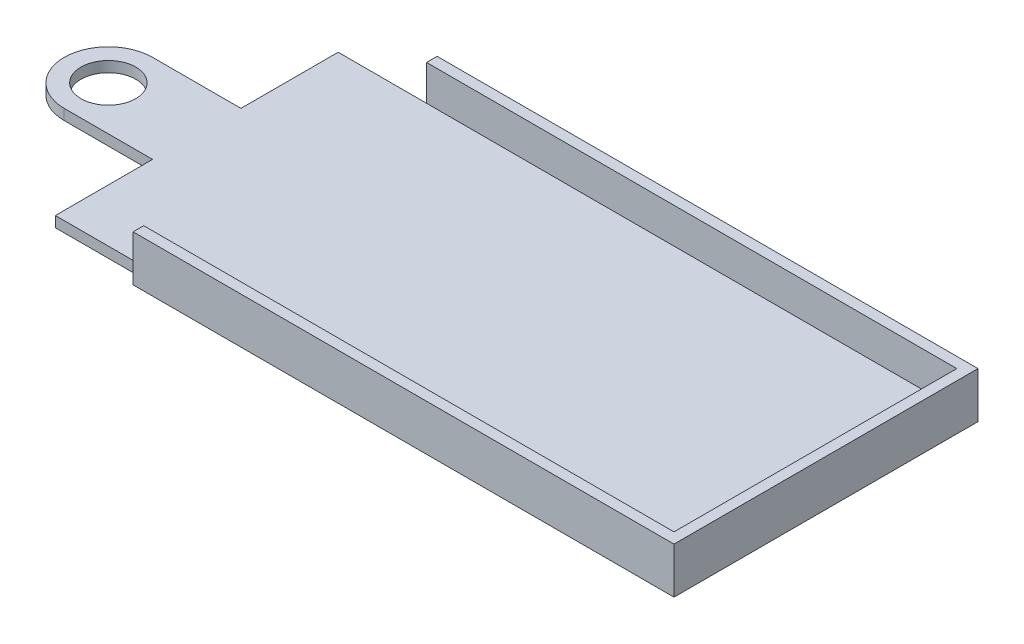
ISO-10303-21;
HEADER;
FILE_DESCRIPTION(('STEP AP214'),'2;1');
FILE_NAME('part.step','',(''),(''),'','','');
FILE_SCHEMA(('AUTOMOTIVE_DESIGN { 1 0 10303 214 1 1 1 1 }'));
ENDSEC;
DATA;
#1=APPLICATION_CONTEXT('core data for automotive mechanical design processes');
#2=APPLICATION_PROTOCOL_DEFINITION('international standard','automotive_design',2000,#1);
#3=PRODUCT_CONTEXT('',#1,'mechanical');
#4=PRODUCT('Part','Part','',(#3));
#5=PRODUCT_RELATED_PRODUCT_CATEGORY('part','',(#4));
#6=PRODUCT_DEFINITION_FORMATION('','',#4);
#7=PRODUCT_DEFINITION_CONTEXT('part definition',#1,'design');
#8=PRODUCT_DEFINITION('design','',#6,#7);
#9=PRODUCT_DEFINITION_SHAPE('','',#8);
#10=(LENGTH_UNIT() NAMED_UNIT(*) SI_UNIT(.MILLI.,.METRE.));
#11=(NAMED_UNIT(*) PLANE_ANGLE_UNIT() SI_UNIT($,.RADIAN.));
#12=(NAMED_UNIT(*) SI_UNIT($,.STERADIAN.) SOLID_ANGLE_UNIT());
#13=UNCERTAINTY_MEASURE_WITH_UNIT(LENGTH_MEASURE(1.E-05),#10,'distance_accuracy_value','');
#14=(GEOMETRIC_REPRESENTATION_CONTEXT(3) GLOBAL_UNCERTAINTY_ASSIGNED_CONTEXT((#13)) GLOBAL_UNIT_ASSIGNED_CONTEXT((#10,
#11,#12)) REPRESENTATION_CONTEXT('',''));
#15=CARTESIAN_POINT('',(0.,0.,0.));
#16=DIRECTION('',(0.,0.,1.));
#17=DIRECTION('',(1.,0.,0.));
#18=AXIS2_PLACEMENT_3D('',#15,#16,#17);
#19=CARTESIAN_POINT('',(-40.,34.7261092284804,-16.));
#20=DIRECTION('',(-1.,0.,0.));
#21=DIRECTION('',(0.,0.,1.));
#22=AXIS2_PLACEMENT_3D('',#19,#20,#21);
#23=PLANE('',#22);
#24=DIRECTION('',(0.,0.,-1.));
#25=VECTOR('',#24,1.);
#26=CARTESIAN_POINT('',(-40.,1.2,-16.));
#27=LINE('',#26,#25);
#28=CARTESIAN_POINT('',(-40.,1.2,16.));
#29=VERTEX_POINT('',#28);
#30=CARTESIAN_POINT('',(-40.,1.2,5.));
#31=VERTEX_POINT('',#30);
#32=EDGE_CURVE('E188',#29,#31,#27,.T.);
#33=ORIENTED_EDGE('',*,*,#32,.T.);
#34=DIRECTION('',(0.,-1.,0.));
#35=VECTOR('',#34,1.);
#36=CARTESIAN_POINT('',(-40.,19.2277563773199,5.));
#37=LINE('',#36,#35);
#38=CARTESIAN_POINT('',(-40.,0.,5.));
#39=VERTEX_POINT('',#38);
#40=EDGE_CURVE('E165',#31,#39,#37,.T.);
#41=ORIENTED_EDGE('',*,*,#40,.T.);
#42=DIRECTION('',(0.,0.,-1.));
#43=VECTOR('',#42,1.);
#44=CARTESIAN_POINT('',(-40.,0.,-16.));
#45=LINE('',#44,#43);
#46=CARTESIAN_POINT('',(-40.,0.,16.));
#47=VERTEX_POINT('',#46);
#48=EDGE_CURVE('E171',#47,#39,#45,.T.);
#49=ORIENTED_EDGE('',*,*,#48,.F.);
#50=DIRECTION('',(0.,-1.,0.));
#51=VECTOR('',#50,1.);
#52=CARTESIAN_POINT('',(-40.,34.7261092284804,16.));
#53=LINE('',#52,#51);
#54=EDGE_CURVE('E184',#29,#47,#53,.T.);
#55=ORIENTED_EDGE('',*,*,#54,.F.);
#56=EDGE_LOOP('',(#33,#41,#49,#55));
#57=FACE_BOUND('',#56,.T.);
#58=ADVANCED_FACE('F35',(#57),#23,.T.);
#59=CARTESIAN_POINT('',(-30.,1.2,16.));
#60=DIRECTION('',(1.,0.,0.));
#61=DIRECTION('',(0.,0.,-1.));
#62=AXIS2_PLACEMENT_3D('',#59,#60,#61);
#63=PLANE('',#62);
#64=DIRECTION('',(0.,-1.,0.));
#65=VECTOR('',#64,1.);
#66=CARTESIAN_POINT('',(-30.,34.7261092284804,-16.));
#67=LINE('',#66,#65);
#68=CARTESIAN_POINT('',(-30.,1.2,-16.));
#69=VERTEX_POINT('',#68);
#70=CARTESIAN_POINT('',(-30.,0.,-16.));
#71=VERTEX_POINT('',#70);
#72=EDGE_CURVE('E187',#69,#71,#67,.T.);
#73=ORIENTED_EDGE('',*,*,#72,.F.);
#74=DIRECTION('',(0.,-1.,0.));
#75=VECTOR('',#74,1.);
#76=CARTESIAN_POINT('',(-30.,79.4054128967276,-16.));
#77=LINE('',#76,#75);
#78=CARTESIAN_POINT('',(-30.,5.2,-16.));
#79=VERTEX_POINT('',#78);
#80=EDGE_CURVE('E231',#79,#69,#77,.T.);
#81=ORIENTED_EDGE('',*,*,#80,.F.);
#82=DIRECTION('',(0.,0.,-1.));
#83=VECTOR('',#82,1.);
#84=CARTESIAN_POINT('',(-30.,5.2,-16.));
#85=LINE('',#84,#83);
#86=CARTESIAN_POINT('',(-30.,5.2,-17.2));
#87=VERTEX_POINT('',#86);
#88=EDGE_CURVE('E228',#79,#87,#85,.T.);
#89=ORIENTED_EDGE('',*,*,#88,.T.);
#90=DIRECTION('',(0.,-1.,0.));
#91=VECTOR('',#90,1.);
#92=CARTESIAN_POINT('',(-30.,79.4054128967276,-17.2));
#93=LINE('',#92,#91);
#94=CARTESIAN_POINT('',(-30.,0.,-17.2));
#95=VERTEX_POINT('',#94);
#96=EDGE_CURVE('E227',#87,#95,#93,.T.);
#97=ORIENTED_EDGE('',*,*,#96,.T.);
#98=DIRECTION('',(0.,0.,1.));
#99=VECTOR('',#98,1.);
#100=CARTESIAN_POINT('',(-30.,0.,16.));
#101=LINE('',#100,#99);
#102=EDGE_CURVE('E257',#95,#71,#101,.T.);
#103=ORIENTED_EDGE('',*,*,#102,.T.);
#104=EDGE_LOOP('',(#73,#81,#89,#97,#103));
#105=FACE_BOUND('',#104,.T.);
#106=ADVANCED_FACE('F322',(#105),#63,.F.);
#107=DIRECTION('',(0.,-1.,0.));
#108=VECTOR('',#107,1.);
#109=CARTESIAN_POINT('',(-30.,79.4054128967276,16.));
#110=LINE('',#109,#108);
#111=CARTESIAN_POINT('',(-30.,5.2,16.));
#112=VERTEX_POINT('',#111);
#113=CARTESIAN_POINT('',(-30.,1.2,16.));
#114=VERTEX_POINT('',#113);
#115=EDGE_CURVE('E214',#112,#114,#110,.T.);
#116=ORIENTED_EDGE('',*,*,#115,.T.);
#117=DIRECTION('',(0.,-1.,0.));
#118=VECTOR('',#117,1.);
#119=CARTESIAN_POINT('',(-30.,34.7261092284804,16.));
#120=LINE('',#119,#118);
#121=CARTESIAN_POINT('',(-30.,0.,16.));
#122=VERTEX_POINT('',#121);
#123=EDGE_CURVE('E193',#114,#122,#120,.T.);
#124=ORIENTED_EDGE('',*,*,#123,.T.);
#125=CARTESIAN_POINT('',(-30.,0.,17.2));
#126=VERTEX_POINT('',#125);
#127=EDGE_CURVE('E253',#122,#126,#101,.T.);
#128=ORIENTED_EDGE('',*,*,#127,.T.);
#129=DIRECTION('',(0.,-1.,0.));
#130=VECTOR('',#129,1.);
#131=CARTESIAN_POINT('',(-30.,79.4054128967276,17.2));
#132=LINE('',#131,#130);
#133=CARTESIAN_POINT('',(-30.,5.2,17.2));
#134=VERTEX_POINT('',#133);
#135=EDGE_CURVE('E215',#134,#126,#132,.T.);
#136=ORIENTED_EDGE('',*,*,#135,.F.);
#137=DIRECTION('',(0.,0.,-1.));
#138=VECTOR('',#137,1.);
#139=CARTESIAN_POINT('',(-30.,5.2,16.));
#140=LINE('',#139,#138);
#141=EDGE_CURVE('E211',#134,#112,#140,.T.);
#142=ORIENTED_EDGE('',*,*,#141,.T.);
#143=EDGE_LOOP('',(#116,#124,#128,#136,#142));
#144=FACE_BOUND('',#143,.T.);
#145=ADVANCED_FACE('F303',(#144),#63,.F.);
#146=CARTESIAN_POINT('',(0.,1.2,0.));
#147=DIRECTION('',(0.,1.,0.));
#148=DIRECTION('',(0.,0.,1.));
#149=AXIS2_PLACEMENT_3D('',#146,#147,#148);
#150=PLANE('',#149);
#151=CARTESIAN_POINT('',(-50.,1.2,0.));
#152=DIRECTION('',(0.,1.,0.));
#153=DIRECTION('',(0.,0.,1.));
#154=AXIS2_PLACEMENT_3D('',#151,#152,#153);
#155=CIRCLE('',#154,3.1);
#156=CARTESIAN_POINT('',(-50.,1.2,3.1));
#157=VERTEX_POINT('',#156);
#158=EDGE_CURVE('E287',#157,#157,#155,.F.);
#159=ORIENTED_EDGE('',*,*,#158,.T.);
#160=EDGE_LOOP('',(#159));
#161=FACE_BOUND('',#160,.T.);
#162=CARTESIAN_POINT('',(-50.,1.2,0.));
#163=DIRECTION('',(0.,1.,0.));
#164=DIRECTION('',(0.,0.,1.));
#165=AXIS2_PLACEMENT_3D('',#162,#163,#164);
#166=CIRCLE('',#165,5.);
#167=CARTESIAN_POINT('',(-50.,1.2,-5.));
#168=VERTEX_POINT('',#167);
#169=CARTESIAN_POINT('',(-55.,1.2,0.));
#170=VERTEX_POINT('',#169);
#171=EDGE_CURVE('E51',#168,#170,#166,.T.);
#172=ORIENTED_EDGE('',*,*,#171,.T.);
#173=CARTESIAN_POINT('',(-50.,1.2,0.));
#174=DIRECTION('',(0.,1.,0.));
#175=DIRECTION('',(0.,0.,1.));
#176=AXIS2_PLACEMENT_3D('',#173,#174,#175);
#177=CIRCLE('',#176,5.);
#178=CARTESIAN_POINT('',(-50.,1.2,5.));
#179=VERTEX_POINT('',#178);
#180=EDGE_CURVE('E44',#170,#179,#177,.T.);
#181=ORIENTED_EDGE('',*,*,#180,.T.);
#182=DIRECTION('',(-1.,0.,0.));
#183=VECTOR('',#182,1.);
#184=CARTESIAN_POINT('',(-40.,1.2,5.));
#185=LINE('',#184,#183);
#186=EDGE_CURVE('E156',#31,#179,#185,.T.);
#187=ORIENTED_EDGE('',*,*,#186,.F.);
#188=ORIENTED_EDGE('',*,*,#32,.F.);
#189=DIRECTION('',(-1.,0.,0.));
#190=VECTOR('',#189,1.);
#191=CARTESIAN_POINT('',(-30.,1.2,16.));
#192=LINE('',#191,#190);
#193=EDGE_CURVE('E181',#114,#29,#192,.T.);
#194=ORIENTED_EDGE('',*,*,#193,.F.);
#195=DIRECTION('',(1.,0.,0.));
#196=VECTOR('',#195,1.);
#197=CARTESIAN_POINT('',(30.,1.2,16.));
#198=LINE('',#197,#196);
#199=CARTESIAN_POINT('',(30.,1.2,16.));
#200=VERTEX_POINT('',#199);
#201=EDGE_CURVE('E254',#114,#200,#198,.T.);
#202=ORIENTED_EDGE('',*,*,#201,.T.);
#203=DIRECTION('',(0.,0.,-1.));
#204=VECTOR('',#203,1.);
#205=CARTESIAN_POINT('',(30.,1.2,16.));
#206=LINE('',#205,#204);
#207=CARTESIAN_POINT('',(30.,1.2,-16.));
#208=VERTEX_POINT('',#207);
#209=EDGE_CURVE('E256',#200,#208,#206,.T.);
#210=ORIENTED_EDGE('',*,*,#209,.T.);
#211=DIRECTION('',(-1.,0.,0.));
#212=VECTOR('',#211,1.);
#213=CARTESIAN_POINT('',(30.,1.2,-16.));
#214=LINE('',#213,#212);
#215=EDGE_CURVE('E259',#208,#69,#214,.T.);
#216=ORIENTED_EDGE('',*,*,#215,.T.);
#217=DIRECTION('',(1.,0.,0.));
#218=VECTOR('',#217,1.);
#219=CARTESIAN_POINT('',(-30.,1.2,-16.));
#220=LINE('',#219,#218);
#221=CARTESIAN_POINT('',(-40.,1.2,-16.));
#222=VERTEX_POINT('',#221);
#223=EDGE_CURVE('E185',#222,#69,#220,.T.);
#224=ORIENTED_EDGE('',*,*,#223,.F.);
#225=CARTESIAN_POINT('',(-40.,1.2,-5.));
#226=VERTEX_POINT('',#225);
#227=EDGE_CURVE('E191',#226,#222,#27,.T.);
#228=ORIENTED_EDGE('',*,*,#227,.F.);
#229=DIRECTION('',(1.,0.,0.));
#230=VECTOR('',#229,1.);
#231=CARTESIAN_POINT('',(-40.,1.2,-5.));
#232=LINE('',#231,#230);
#233=EDGE_CURVE('E162',#168,#226,#232,.T.);
#234=ORIENTED_EDGE('',*,*,#233,.F.);
#235=EDGE_LOOP('',(#172,#181,#187,#188,#194,#202,#210,#216,#224,#228,#234));
#236=FACE_BOUND('',#235,.T.);
#237=ADVANCED_FACE('F273',(#161,#236),#150,.T.);
#238=CARTESIAN_POINT('',(0.,0.,0.));
#239=DIRECTION('',(0.,1.,0.));
#240=DIRECTION('',(0.,0.,1.));
#241=AXIS2_PLACEMENT_3D('',#238,#239,#240);
#242=PLANE('',#241);
#243=CARTESIAN_POINT('',(-50.,0.,0.));
#244=DIRECTION('',(0.,-1.,0.));
#245=DIRECTION('',(0.,0.,-1.));
#246=AXIS2_PLACEMENT_3D('',#243,#244,#245);
#247=CIRCLE('',#246,3.1);
#248=CARTESIAN_POINT('',(-50.,0.,-3.10000000000001));
#249=VERTEX_POINT('',#248);
#250=EDGE_CURVE('E284',#249,#249,#247,.T.);
#251=ORIENTED_EDGE('',*,*,#250,.F.);
#252=EDGE_LOOP('',(#251));
#253=FACE_BOUND('',#252,.T.);
#254=DIRECTION('',(-1.,0.,0.));
#255=VECTOR('',#254,1.);
#256=CARTESIAN_POINT('',(-40.,0.,5.));
#257=LINE('',#256,#255);
#258=CARTESIAN_POINT('',(-50.,0.,5.));
#259=VERTEX_POINT('',#258);
#260=EDGE_CURVE('E157',#39,#259,#257,.T.);
#261=ORIENTED_EDGE('',*,*,#260,.T.);
#262=CARTESIAN_POINT('',(-50.,0.,0.));
#263=DIRECTION('',(0.,1.,0.));
#264=DIRECTION('',(0.,0.,1.));
#265=AXIS2_PLACEMENT_3D('',#262,#263,#264);
#266=CIRCLE('',#265,5.);
#267=CARTESIAN_POINT('',(-55.,0.,0.));
#268=VERTEX_POINT('',#267);
#269=EDGE_CURVE('E268',#259,#268,#266,.F.);
#270=ORIENTED_EDGE('',*,*,#269,.T.);
#271=CARTESIAN_POINT('',(-50.,0.,0.));
#272=DIRECTION('',(0.,1.,0.));
#273=DIRECTION('',(0.,0.,1.));
#274=AXIS2_PLACEMENT_3D('',#271,#272,#273);
#275=CIRCLE('',#274,5.);
#276=CARTESIAN_POINT('',(-50.,0.,-5.));
#277=VERTEX_POINT('',#276);
#278=EDGE_CURVE('E155',#268,#277,#275,.F.);
#279=ORIENTED_EDGE('',*,*,#278,.T.);
#280=DIRECTION('',(1.,0.,0.));
#281=VECTOR('',#280,1.);
#282=CARTESIAN_POINT('',(-40.,0.,-5.));
#283=LINE('',#282,#281);
#284=CARTESIAN_POINT('',(-40.,0.,-5.));
#285=VERTEX_POINT('',#284);
#286=EDGE_CURVE('E146',#277,#285,#283,.T.);
#287=ORIENTED_EDGE('',*,*,#286,.T.);
#288=CARTESIAN_POINT('',(-40.,0.,-16.));
#289=VERTEX_POINT('',#288);
#290=EDGE_CURVE('E152',#285,#289,#45,.T.);
#291=ORIENTED_EDGE('',*,*,#290,.T.);
#292=DIRECTION('',(1.,0.,0.));
#293=VECTOR('',#292,1.);
#294=CARTESIAN_POINT('',(-30.,0.,-16.));
#295=LINE('',#294,#293);
#296=EDGE_CURVE('E175',#289,#71,#295,.T.);
#297=ORIENTED_EDGE('',*,*,#296,.T.);
#298=ORIENTED_EDGE('',*,*,#102,.F.);
#299=DIRECTION('',(1.,0.,0.));
#300=VECTOR('',#299,1.);
#301=CARTESIAN_POINT('',(-30.,0.,-17.2));
#302=LINE('',#301,#300);
#303=CARTESIAN_POINT('',(31.2,0.,-17.2));
#304=VERTEX_POINT('',#303);
#305=EDGE_CURVE('E198',#95,#304,#302,.T.);
#306=ORIENTED_EDGE('',*,*,#305,.T.);
#307=DIRECTION('',(0.,0.,1.));
#308=VECTOR('',#307,1.);
#309=CARTESIAN_POINT('',(31.2,0.,-17.2));
#310=LINE('',#309,#308);
#311=CARTESIAN_POINT('',(31.2,0.,17.2));
#312=VERTEX_POINT('',#311);
#313=EDGE_CURVE('E203',#304,#312,#310,.T.);
#314=ORIENTED_EDGE('',*,*,#313,.T.);
#315=DIRECTION('',(-1.,0.,0.));
#316=VECTOR('',#315,1.);
#317=CARTESIAN_POINT('',(31.2,0.,17.2));
#318=LINE('',#317,#316);
#319=EDGE_CURVE('E199',#312,#126,#318,.T.);
#320=ORIENTED_EDGE('',*,*,#319,.T.);
#321=ORIENTED_EDGE('',*,*,#127,.F.);
#322=DIRECTION('',(-1.,0.,0.));
#323=VECTOR('',#322,1.);
#324=CARTESIAN_POINT('',(-30.,0.,16.));
#325=LINE('',#324,#323);
#326=EDGE_CURVE('E172',#122,#47,#325,.T.);
#327=ORIENTED_EDGE('',*,*,#326,.T.);
#328=ORIENTED_EDGE('',*,*,#48,.T.);
#329=EDGE_LOOP('',(#261,#270,#279,#287,#291,#297,#298,#306,#314,#320,#321,#327,#328));
#330=FACE_BOUND('',#329,.T.);
#331=ADVANCED_FACE('F149',(#253,#330),#242,.F.);
#332=CARTESIAN_POINT('',(0.,5.2,0.));
#333=DIRECTION('',(0.,1.,0.));
#334=DIRECTION('',(0.,0.,1.));
#335=AXIS2_PLACEMENT_3D('',#332,#333,#334);
#336=PLANE('',#335);
#337=ORIENTED_EDGE('',*,*,#141,.F.);
#338=DIRECTION('',(-1.,0.,0.));
#339=VECTOR('',#338,1.);
#340=CARTESIAN_POINT('',(31.2,5.2,17.2));
#341=LINE('',#340,#339);
#342=CARTESIAN_POINT('',(31.2,5.2,17.2));
#343=VERTEX_POINT('',#342);
#344=EDGE_CURVE('E216',#343,#134,#341,.T.);
#345=ORIENTED_EDGE('',*,*,#344,.F.);
#346=DIRECTION('',(0.,0.,1.));
#347=VECTOR('',#346,1.);
#348=CARTESIAN_POINT('',(31.2,5.2,-17.2));
#349=LINE('',#348,#347);
#350=CARTESIAN_POINT('',(31.2,5.2,-17.2));
#351=VERTEX_POINT('',#350);
#352=EDGE_CURVE('E220',#351,#343,#349,.T.);
#353=ORIENTED_EDGE('',*,*,#352,.F.);
#354=DIRECTION('',(1.,0.,0.));
#355=VECTOR('',#354,1.);
#356=CARTESIAN_POINT('',(-30.,5.2,-17.2));
#357=LINE('',#356,#355);
#358=EDGE_CURVE('E224',#87,#351,#357,.T.);
#359=ORIENTED_EDGE('',*,*,#358,.F.);
#360=ORIENTED_EDGE('',*,*,#88,.F.);
#361=DIRECTION('',(-1.,0.,0.));
#362=VECTOR('',#361,1.);
#363=CARTESIAN_POINT('',(-30.,5.2,-16.));
#364=LINE('',#363,#362);
#365=CARTESIAN_POINT('',(30.,5.2,-16.));
#366=VERTEX_POINT('',#365);
#367=EDGE_CURVE('E232',#366,#79,#364,.T.);
#368=ORIENTED_EDGE('',*,*,#367,.F.);
#369=DIRECTION('',(0.,0.,-1.));
#370=VECTOR('',#369,1.);
#371=CARTESIAN_POINT('',(30.,5.2,-16.));
#372=LINE('',#371,#370);
#373=CARTESIAN_POINT('',(30.,5.2,16.));
#374=VERTEX_POINT('',#373);
#375=EDGE_CURVE('E236',#374,#366,#372,.T.);
#376=ORIENTED_EDGE('',*,*,#375,.F.);
#377=DIRECTION('',(1.,0.,0.));
#378=VECTOR('',#377,1.);
#379=CARTESIAN_POINT('',(30.,5.2,16.));
#380=LINE('',#379,#378);
#381=EDGE_CURVE('E202',#112,#374,#380,.T.);
#382=ORIENTED_EDGE('',*,*,#381,.F.);
#383=EDGE_LOOP('',(#337,#345,#353,#359,#360,#368,#376,#382));
#384=FACE_BOUND('',#383,.T.);
#385=ADVANCED_FACE('F335',(#384),#336,.T.);
#386=CARTESIAN_POINT('',(30.,79.4054128967276,16.));
#387=DIRECTION('',(0.,0.,-1.));
#388=DIRECTION('',(-1.,0.,0.));
#389=AXIS2_PLACEMENT_3D('',#386,#387,#388);
#390=PLANE('',#389);
#391=DIRECTION('',(0.,-1.,0.));
#392=VECTOR('',#391,1.);
#393=CARTESIAN_POINT('',(30.,79.4054128967276,16.));
#394=LINE('',#393,#392);
#395=EDGE_CURVE('E210',#374,#200,#394,.T.);
#396=ORIENTED_EDGE('',*,*,#395,.T.);
#397=ORIENTED_EDGE('',*,*,#201,.F.);
#398=ORIENTED_EDGE('',*,*,#115,.F.);
#399=ORIENTED_EDGE('',*,*,#381,.T.);
#400=EDGE_LOOP('',(#396,#397,#398,#399));
#401=FACE_BOUND('',#400,.T.);
#402=ADVANCED_FACE('F307',(#401),#390,.T.);
#403=CARTESIAN_POINT('',(30.,79.4054128967276,-16.));
#404=DIRECTION('',(-1.,0.,0.));
#405=DIRECTION('',(0.,0.,1.));
#406=AXIS2_PLACEMENT_3D('',#403,#404,#405);
#407=PLANE('',#406);
#408=DIRECTION('',(0.,-1.,0.));
#409=VECTOR('',#408,1.);
#410=CARTESIAN_POINT('',(30.,79.4054128967276,-16.));
#411=LINE('',#410,#409);
#412=EDGE_CURVE('E235',#366,#208,#411,.T.);
#413=ORIENTED_EDGE('',*,*,#412,.T.);
#414=ORIENTED_EDGE('',*,*,#209,.F.);
#415=ORIENTED_EDGE('',*,*,#395,.F.);
#416=ORIENTED_EDGE('',*,*,#375,.T.);
#417=EDGE_LOOP('',(#413,#414,#415,#416));
#418=FACE_BOUND('',#417,.T.);
#419=ADVANCED_FACE('F312',(#418),#407,.T.);
#420=CARTESIAN_POINT('',(-30.,79.4054128967276,-16.));
#421=DIRECTION('',(0.,0.,1.));
#422=DIRECTION('',(1.,0.,0.));
#423=AXIS2_PLACEMENT_3D('',#420,#421,#422);
#424=PLANE('',#423);
#425=ORIENTED_EDGE('',*,*,#80,.T.);
#426=ORIENTED_EDGE('',*,*,#215,.F.);
#427=ORIENTED_EDGE('',*,*,#412,.F.);
#428=ORIENTED_EDGE('',*,*,#367,.T.);
#429=EDGE_LOOP('',(#425,#426,#427,#428));
#430=FACE_BOUND('',#429,.T.);
#431=ADVANCED_FACE('F315',(#430),#424,.T.);
#432=CARTESIAN_POINT('',(-30.,79.4054128967276,-17.2));
#433=DIRECTION('',(0.,0.,-1.));
#434=DIRECTION('',(-1.,0.,0.));
#435=AXIS2_PLACEMENT_3D('',#432,#433,#434);
#436=PLANE('',#435);
#437=ORIENTED_EDGE('',*,*,#96,.F.);
#438=ORIENTED_EDGE('',*,*,#358,.T.);
#439=DIRECTION('',(0.,-1.,0.));
#440=VECTOR('',#439,1.);
#441=CARTESIAN_POINT('',(31.2,79.4054128967276,-17.2));
#442=LINE('',#441,#440);
#443=EDGE_CURVE('E223',#351,#304,#442,.T.);
#444=ORIENTED_EDGE('',*,*,#443,.T.);
#445=ORIENTED_EDGE('',*,*,#305,.F.);
#446=EDGE_LOOP('',(#437,#438,#444,#445));
#447=FACE_BOUND('',#446,.T.);
#448=ADVANCED_FACE('F326',(#447),#436,.T.);
#449=CARTESIAN_POINT('',(31.2,79.4054128967276,-17.2));
#450=DIRECTION('',(1.,0.,0.));
#451=DIRECTION('',(0.,0.,-1.));
#452=AXIS2_PLACEMENT_3D('',#449,#450,#451);
#453=PLANE('',#452);
#454=ORIENTED_EDGE('',*,*,#443,.F.);
#455=ORIENTED_EDGE('',*,*,#352,.T.);
#456=DIRECTION('',(0.,-1.,0.));
#457=VECTOR('',#456,1.);
#458=CARTESIAN_POINT('',(31.2,79.4054128967276,17.2));
#459=LINE('',#458,#457);
#460=EDGE_CURVE('E219',#343,#312,#459,.T.);
#461=ORIENTED_EDGE('',*,*,#460,.T.);
#462=ORIENTED_EDGE('',*,*,#313,.F.);
#463=EDGE_LOOP('',(#454,#455,#461,#462));
#464=FACE_BOUND('',#463,.T.);
#465=ADVANCED_FACE('F336',(#464),#453,.T.);
#466=CARTESIAN_POINT('',(31.2,79.4054128967276,17.2));
#467=DIRECTION('',(0.,0.,1.));
#468=DIRECTION('',(1.,0.,0.));
#469=AXIS2_PLACEMENT_3D('',#466,#467,#468);
#470=PLANE('',#469);
#471=ORIENTED_EDGE('',*,*,#460,.F.);
#472=ORIENTED_EDGE('',*,*,#344,.T.);
#473=ORIENTED_EDGE('',*,*,#135,.T.);
#474=ORIENTED_EDGE('',*,*,#319,.F.);
#475=EDGE_LOOP('',(#471,#472,#473,#474));
#476=FACE_BOUND('',#475,.T.);
#477=ADVANCED_FACE('F333',(#476),#470,.T.);
#478=CARTESIAN_POINT('',(-30.,34.7261092284804,16.));
#479=DIRECTION('',(0.,0.,1.));
#480=DIRECTION('',(1.,0.,0.));
#481=AXIS2_PLACEMENT_3D('',#478,#479,#480);
#482=PLANE('',#481);
#483=ORIENTED_EDGE('',*,*,#123,.F.);
#484=ORIENTED_EDGE('',*,*,#193,.T.);
#485=ORIENTED_EDGE('',*,*,#54,.T.);
#486=ORIENTED_EDGE('',*,*,#326,.F.);
#487=EDGE_LOOP('',(#483,#484,#485,#486));
#488=FACE_BOUND('',#487,.T.);
#489=ADVANCED_FACE('F300',(#488),#482,.T.);
#490=DIRECTION('',(0.,-1.,0.));
#491=VECTOR('',#490,1.);
#492=CARTESIAN_POINT('',(-40.,19.2277563773199,-5.));
#493=LINE('',#492,#491);
#494=EDGE_CURVE('E160',#226,#285,#493,.T.);
#495=ORIENTED_EDGE('',*,*,#494,.F.);
#496=ORIENTED_EDGE('',*,*,#227,.T.);
#497=DIRECTION('',(0.,-1.,0.));
#498=VECTOR('',#497,1.);
#499=CARTESIAN_POINT('',(-40.,34.7261092284804,-16.));
#500=LINE('',#499,#498);
#501=EDGE_CURVE('E169',#222,#289,#500,.T.);
#502=ORIENTED_EDGE('',*,*,#501,.T.);
#503=ORIENTED_EDGE('',*,*,#290,.F.);
#504=EDGE_LOOP('',(#495,#496,#502,#503));
#505=FACE_BOUND('',#504,.T.);
#506=ADVANCED_FACE('F167',(#505),#23,.T.);
#507=CARTESIAN_POINT('',(-30.,34.7261092284804,-16.));
#508=DIRECTION('',(0.,0.,-1.));
#509=DIRECTION('',(-1.,0.,0.));
#510=AXIS2_PLACEMENT_3D('',#507,#508,#509);
#511=PLANE('',#510);
#512=ORIENTED_EDGE('',*,*,#501,.F.);
#513=ORIENTED_EDGE('',*,*,#223,.T.);
#514=ORIENTED_EDGE('',*,*,#72,.T.);
#515=ORIENTED_EDGE('',*,*,#296,.F.);
#516=EDGE_LOOP('',(#512,#513,#514,#515));
#517=FACE_BOUND('',#516,.T.);
#518=ADVANCED_FACE('F320',(#517),#511,.T.);
#519=CARTESIAN_POINT('',(-40.,19.2277563773199,5.));
#520=DIRECTION('',(0.,0.,1.));
#521=DIRECTION('',(1.,0.,0.));
#522=AXIS2_PLACEMENT_3D('',#519,#520,#521);
#523=PLANE('',#522);
#524=ORIENTED_EDGE('',*,*,#186,.T.);
#525=DIRECTION('',(0.,-1.,0.));
#526=VECTOR('',#525,1.);
#527=CARTESIAN_POINT('',(-50.,19.2277563773199,5.));
#528=LINE('',#527,#526);
#529=EDGE_CURVE('E262',#179,#259,#528,.T.);
#530=ORIENTED_EDGE('',*,*,#529,.T.);
#531=ORIENTED_EDGE('',*,*,#260,.F.);
#532=ORIENTED_EDGE('',*,*,#40,.F.);
#533=EDGE_LOOP('',(#524,#530,#531,#532));
#534=FACE_BOUND('',#533,.T.);
#535=ADVANCED_FACE('F279',(#534),#523,.T.);
#536=CARTESIAN_POINT('',(-40.,19.2277563773199,-5.));
#537=DIRECTION('',(0.,0.,-1.));
#538=DIRECTION('',(-1.,0.,0.));
#539=AXIS2_PLACEMENT_3D('',#536,#537,#538);
#540=PLANE('',#539);
#541=ORIENTED_EDGE('',*,*,#286,.F.);
#542=DIRECTION('',(0.,-1.,0.));
#543=VECTOR('',#542,1.);
#544=CARTESIAN_POINT('',(-50.,19.2277563773199,-5.));
#545=LINE('',#544,#543);
#546=EDGE_CURVE('E12',#277,#168,#545,.F.);
#547=ORIENTED_EDGE('',*,*,#546,.T.);
#548=ORIENTED_EDGE('',*,*,#233,.T.);
#549=ORIENTED_EDGE('',*,*,#494,.T.);
#550=EDGE_LOOP('',(#541,#547,#548,#549));
#551=FACE_BOUND('',#550,.T.);
#552=ADVANCED_FACE('F161',(#551),#540,.T.);
#553=CARTESIAN_POINT('',(-50.,19.2277563773199,0.));
#554=DIRECTION('',(0.,-1.,0.));
#555=DIRECTION('',(0.,0.,-1.));
#556=AXIS2_PLACEMENT_3D('',#553,#554,#555);
#557=CYLINDRICAL_SURFACE('',#556,5.);
#558=DIRECTION('',(0.,-1.,0.));
#559=VECTOR('',#558,1.);
#560=CARTESIAN_POINT('',(-55.,19.2277563773199,0.));
#561=LINE('',#560,#559);
#562=EDGE_CURVE('E39',#170,#268,#561,.T.);
#563=ORIENTED_EDGE('',*,*,#562,.F.);
#564=ORIENTED_EDGE('',*,*,#171,.F.);
#565=ORIENTED_EDGE('',*,*,#546,.F.);
#566=ORIENTED_EDGE('',*,*,#278,.F.);
#567=EDGE_LOOP('',(#563,#564,#565,#566));
#568=FACE_BOUND('',#567,.T.);
#569=ADVANCED_FACE('F37',(#568),#557,.T.);
#570=CARTESIAN_POINT('',(-50.,19.2277563773199,0.));
#571=DIRECTION('',(0.,-1.,0.));
#572=DIRECTION('',(0.,0.,-1.));
#573=AXIS2_PLACEMENT_3D('',#570,#571,#572);
#574=CYLINDRICAL_SURFACE('',#573,5.);
#575=ORIENTED_EDGE('',*,*,#180,.F.);
#576=ORIENTED_EDGE('',*,*,#562,.T.);
#577=ORIENTED_EDGE('',*,*,#269,.F.);
#578=ORIENTED_EDGE('',*,*,#529,.F.);
#579=EDGE_LOOP('',(#575,#576,#577,#578));
#580=FACE_BOUND('',#579,.T.);
#581=ADVANCED_FACE('F282',(#580),#574,.T.);
#582=CARTESIAN_POINT('',(-50.,5.201,0.));
#583=DIRECTION('',(0.,-1.,0.));
#584=DIRECTION('',(0.,0.,-1.));
#585=AXIS2_PLACEMENT_3D('',#582,#583,#584);
#586=CYLINDRICAL_SURFACE('',#585,3.1);
#587=ORIENTED_EDGE('',*,*,#158,.F.);
#588=EDGE_LOOP('',(#587));
#589=FACE_BOUND('',#588,.T.);
#590=ORIENTED_EDGE('',*,*,#250,.T.);
#591=EDGE_LOOP('',(#590));
#592=FACE_BOUND('',#591,.T.);
#593=ADVANCED_FACE('F450',(#589,#592),#586,.F.);
#594=CLOSED_SHELL('',(#58,#106,#145,#237,#331,#385,#402,#419,#431,#448,#465,#477,#489,#506,#518,
#535,#552,#569,#581,#593));
#595=MANIFOLD_SOLID_BREP('B2',#594);
#596=ADVANCED_BREP_SHAPE_REPRESENTATION('',(#18,#595),#14);
#597=SHAPE_DEFINITION_REPRESENTATION(#9,#596);
ENDSEC;
END-ISO-10303-21;
